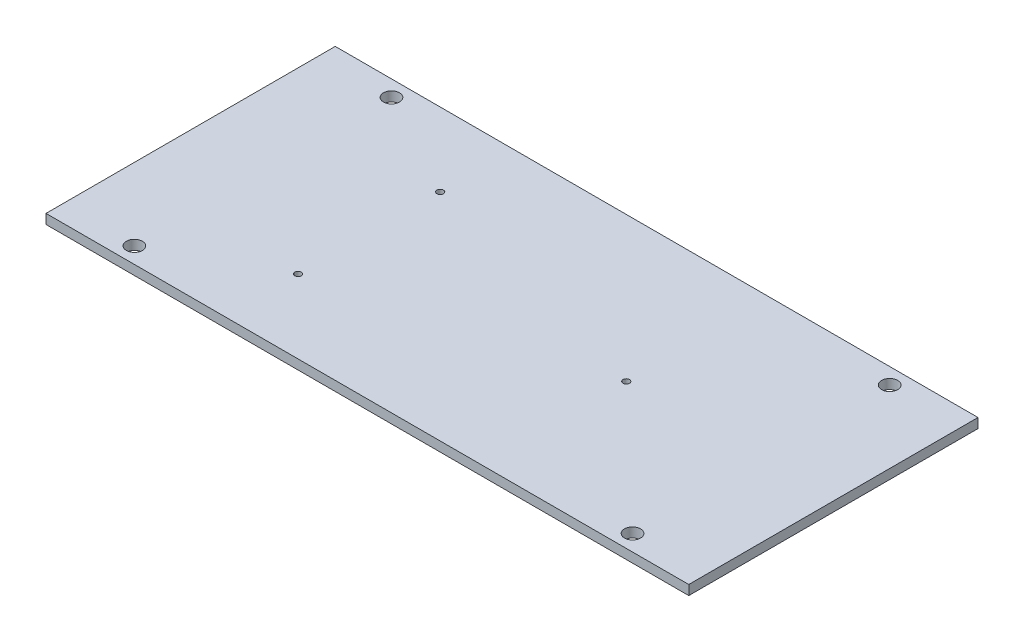
ISO-10303-21;
HEADER;
FILE_DESCRIPTION(('STEP AP214'),'2;1');
FILE_NAME('part.step','',(''),(''),'','','');
FILE_SCHEMA(('AUTOMOTIVE_DESIGN { 1 0 10303 214 1 1 1 1 }'));
ENDSEC;
DATA;
#1=APPLICATION_CONTEXT('core data for automotive mechanical design processes');
#2=APPLICATION_PROTOCOL_DEFINITION('international standard','automotive_design',2000,#1);
#3=PRODUCT_CONTEXT('',#1,'mechanical');
#4=PRODUCT('Part','Part','',(#3));
#5=PRODUCT_RELATED_PRODUCT_CATEGORY('part','',(#4));
#6=PRODUCT_DEFINITION_FORMATION('','',#4);
#7=PRODUCT_DEFINITION_CONTEXT('part definition',#1,'design');
#8=PRODUCT_DEFINITION('design','',#6,#7);
#9=PRODUCT_DEFINITION_SHAPE('','',#8);
#10=(LENGTH_UNIT() NAMED_UNIT(*) SI_UNIT(.MILLI.,.METRE.));
#11=(NAMED_UNIT(*) PLANE_ANGLE_UNIT() SI_UNIT($,.RADIAN.));
#12=(NAMED_UNIT(*) SI_UNIT($,.STERADIAN.) SOLID_ANGLE_UNIT());
#13=UNCERTAINTY_MEASURE_WITH_UNIT(LENGTH_MEASURE(1.E-05),#10,'distance_accuracy_value','');
#14=(GEOMETRIC_REPRESENTATION_CONTEXT(3) GLOBAL_UNCERTAINTY_ASSIGNED_CONTEXT((#13)) GLOBAL_UNIT_ASSIGNED_CONTEXT((#10,
#11,#12)) REPRESENTATION_CONTEXT('',''));
#15=CARTESIAN_POINT('',(0.,0.,0.));
#16=DIRECTION('',(0.,0.,1.));
#17=DIRECTION('',(1.,0.,0.));
#18=AXIS2_PLACEMENT_3D('',#15,#16,#17);
#19=CARTESIAN_POINT('',(100.,3.,45.));
#20=DIRECTION('',(-1.,0.,0.));
#21=DIRECTION('',(0.,0.,1.));
#22=AXIS2_PLACEMENT_3D('',#19,#20,#21);
#23=PLANE('',#22);
#24=DIRECTION('',(0.,0.,-1.));
#25=VECTOR('',#24,1.);
#26=CARTESIAN_POINT('',(100.,0.,45.));
#27=LINE('',#26,#25);
#28=CARTESIAN_POINT('',(100.,0.,45.));
#29=VERTEX_POINT('',#28);
#30=CARTESIAN_POINT('',(100.,0.,-45.));
#31=VERTEX_POINT('',#30);
#32=EDGE_CURVE('E100',#29,#31,#27,.T.);
#33=ORIENTED_EDGE('',*,*,#32,.T.);
#34=DIRECTION('',(0.,-1.,0.));
#35=VECTOR('',#34,1.);
#36=CARTESIAN_POINT('',(100.,3.,-45.));
#37=LINE('',#36,#35);
#38=CARTESIAN_POINT('',(100.,3.,-45.));
#39=VERTEX_POINT('',#38);
#40=EDGE_CURVE('E11',#39,#31,#37,.T.);
#41=ORIENTED_EDGE('',*,*,#40,.F.);
#42=DIRECTION('',(0.,0.,-1.));
#43=VECTOR('',#42,1.);
#44=CARTESIAN_POINT('',(100.,3.,45.));
#45=LINE('',#44,#43);
#46=CARTESIAN_POINT('',(100.,3.,45.));
#47=VERTEX_POINT('',#46);
#48=EDGE_CURVE('E88',#47,#39,#45,.T.);
#49=ORIENTED_EDGE('',*,*,#48,.F.);
#50=DIRECTION('',(0.,-1.,0.));
#51=VECTOR('',#50,1.);
#52=CARTESIAN_POINT('',(100.,3.,45.));
#53=LINE('',#52,#51);
#54=EDGE_CURVE('E96',#47,#29,#53,.T.);
#55=ORIENTED_EDGE('',*,*,#54,.T.);
#56=EDGE_LOOP('',(#33,#41,#49,#55));
#57=FACE_BOUND('',#56,.T.);
#58=ADVANCED_FACE('F37',(#57),#23,.F.);
#59=CARTESIAN_POINT('',(-100.,3.,-45.));
#60=DIRECTION('',(0.,0.,1.));
#61=DIRECTION('',(1.,0.,0.));
#62=AXIS2_PLACEMENT_3D('',#59,#60,#61);
#63=PLANE('',#62);
#64=DIRECTION('',(-1.,0.,0.));
#65=VECTOR('',#64,1.);
#66=CARTESIAN_POINT('',(-100.,0.,-45.));
#67=LINE('',#66,#65);
#68=CARTESIAN_POINT('',(-100.,0.,-45.));
#69=VERTEX_POINT('',#68);
#70=EDGE_CURVE('E92',#31,#69,#67,.T.);
#71=ORIENTED_EDGE('',*,*,#70,.T.);
#72=DIRECTION('',(0.,-1.,0.));
#73=VECTOR('',#72,1.);
#74=CARTESIAN_POINT('',(-100.,3.,-45.));
#75=LINE('',#74,#73);
#76=CARTESIAN_POINT('',(-100.,3.,-45.));
#77=VERTEX_POINT('',#76);
#78=EDGE_CURVE('E45',#77,#69,#75,.T.);
#79=ORIENTED_EDGE('',*,*,#78,.F.);
#80=DIRECTION('',(-1.,0.,0.));
#81=VECTOR('',#80,1.);
#82=CARTESIAN_POINT('',(-100.,3.,-45.));
#83=LINE('',#82,#81);
#84=EDGE_CURVE('E83',#39,#77,#83,.T.);
#85=ORIENTED_EDGE('',*,*,#84,.F.);
#86=ORIENTED_EDGE('',*,*,#40,.T.);
#87=EDGE_LOOP('',(#71,#79,#85,#86));
#88=FACE_BOUND('',#87,.T.);
#89=ADVANCED_FACE('F91',(#88),#63,.F.);
#90=CARTESIAN_POINT('',(-100.,3.,45.));
#91=DIRECTION('',(1.,0.,0.));
#92=DIRECTION('',(0.,0.,-1.));
#93=AXIS2_PLACEMENT_3D('',#90,#91,#92);
#94=PLANE('',#93);
#95=DIRECTION('',(0.,0.,1.));
#96=VECTOR('',#95,1.);
#97=CARTESIAN_POINT('',(-100.,0.,45.));
#98=LINE('',#97,#96);
#99=CARTESIAN_POINT('',(-100.,0.,45.));
#100=VERTEX_POINT('',#99);
#101=EDGE_CURVE('E70',#69,#100,#98,.T.);
#102=ORIENTED_EDGE('',*,*,#101,.T.);
#103=DIRECTION('',(0.,-1.,0.));
#104=VECTOR('',#103,1.);
#105=CARTESIAN_POINT('',(-100.,3.,45.));
#106=LINE('',#105,#104);
#107=CARTESIAN_POINT('',(-100.,3.,45.));
#108=VERTEX_POINT('',#107);
#109=EDGE_CURVE('E93',#108,#100,#106,.T.);
#110=ORIENTED_EDGE('',*,*,#109,.F.);
#111=DIRECTION('',(0.,0.,1.));
#112=VECTOR('',#111,1.);
#113=CARTESIAN_POINT('',(-100.,3.,45.));
#114=LINE('',#113,#112);
#115=EDGE_CURVE('E86',#77,#108,#114,.T.);
#116=ORIENTED_EDGE('',*,*,#115,.F.);
#117=ORIENTED_EDGE('',*,*,#78,.T.);
#118=EDGE_LOOP('',(#102,#110,#116,#117));
#119=FACE_BOUND('',#118,.T.);
#120=ADVANCED_FACE('F94',(#119),#94,.F.);
#121=CARTESIAN_POINT('',(-100.,3.,45.));
#122=DIRECTION('',(0.,0.,-1.));
#123=DIRECTION('',(-1.,0.,0.));
#124=AXIS2_PLACEMENT_3D('',#121,#122,#123);
#125=PLANE('',#124);
#126=DIRECTION('',(1.,0.,0.));
#127=VECTOR('',#126,1.);
#128=CARTESIAN_POINT('',(-100.,0.,45.));
#129=LINE('',#128,#127);
#130=EDGE_CURVE('E76',#100,#29,#129,.T.);
#131=ORIENTED_EDGE('',*,*,#130,.T.);
#132=ORIENTED_EDGE('',*,*,#54,.F.);
#133=DIRECTION('',(1.,0.,0.));
#134=VECTOR('',#133,1.);
#135=CARTESIAN_POINT('',(-100.,3.,45.));
#136=LINE('',#135,#134);
#137=EDGE_CURVE('E53',#108,#47,#136,.T.);
#138=ORIENTED_EDGE('',*,*,#137,.F.);
#139=ORIENTED_EDGE('',*,*,#109,.T.);
#140=EDGE_LOOP('',(#131,#132,#138,#139));
#141=FACE_BOUND('',#140,.T.);
#142=ADVANCED_FACE('F108',(#141),#125,.F.);
#143=CARTESIAN_POINT('',(0.,3.,0.));
#144=DIRECTION('',(0.,-1.,0.));
#145=DIRECTION('',(0.,0.,-1.));
#146=AXIS2_PLACEMENT_3D('',#143,#144,#145);
#147=PLANE('',#146);
#148=CARTESIAN_POINT('',(-44.4499999999999,3.,-22.098));
#149=DIRECTION('',(0.,1.,0.));
#150=DIRECTION('',(0.,0.,1.));
#151=AXIS2_PLACEMENT_3D('',#148,#149,#150);
#152=CIRCLE('',#151,1.0159999999979);
#153=CARTESIAN_POINT('',(-44.4499999999999,3.,-21.0820000000021));
#154=VERTEX_POINT('',#153);
#155=EDGE_CURVE('E150',#154,#154,#152,.T.);
#156=ORIENTED_EDGE('',*,*,#155,.F.);
#157=EDGE_LOOP('',(#156));
#158=FACE_BOUND('',#157,.T.);
#159=CARTESIAN_POINT('',(-44.45,3.,22.098));
#160=DIRECTION('',(0.,1.,0.));
#161=DIRECTION('',(0.,0.,1.));
#162=AXIS2_PLACEMENT_3D('',#159,#160,#161);
#163=CIRCLE('',#162,1.0159999999979);
#164=CARTESIAN_POINT('',(-44.45,3.,23.1139999999979));
#165=VERTEX_POINT('',#164);
#166=EDGE_CURVE('E144',#165,#165,#163,.T.);
#167=ORIENTED_EDGE('',*,*,#166,.F.);
#168=EDGE_LOOP('',(#167));
#169=FACE_BOUND('',#168,.T.);
#170=CARTESIAN_POINT('',(35.56,3.,0.));
#171=DIRECTION('',(0.,1.,0.));
#172=DIRECTION('',(0.,0.,1.));
#173=AXIS2_PLACEMENT_3D('',#170,#171,#172);
#174=CIRCLE('',#173,1.0159999999979);
#175=CARTESIAN_POINT('',(35.56,3.,1.01599999999789));
#176=VERTEX_POINT('',#175);
#177=EDGE_CURVE('E138',#176,#176,#174,.T.);
#178=ORIENTED_EDGE('',*,*,#177,.F.);
#179=EDGE_LOOP('',(#178));
#180=FACE_BOUND('',#179,.T.);
#181=CARTESIAN_POINT('',(-77.5,3.,40.));
#182=DIRECTION('',(0.,1.,0.));
#183=DIRECTION('',(0.,0.,1.));
#184=AXIS2_PLACEMENT_3D('',#181,#182,#183);
#185=CIRCLE('',#184,2.50000000000001);
#186=CARTESIAN_POINT('',(-77.5,3.,42.5));
#187=VERTEX_POINT('',#186);
#188=EDGE_CURVE('E120',#187,#187,#185,.T.);
#189=ORIENTED_EDGE('',*,*,#188,.F.);
#190=EDGE_LOOP('',(#189));
#191=FACE_BOUND('',#190,.T.);
#192=CARTESIAN_POINT('',(77.5,3.,40.));
#193=DIRECTION('',(0.,1.,0.));
#194=DIRECTION('',(0.,0.,1.));
#195=AXIS2_PLACEMENT_3D('',#192,#193,#194);
#196=CIRCLE('',#195,2.50000000000001);
#197=CARTESIAN_POINT('',(77.5,3.,42.5));
#198=VERTEX_POINT('',#197);
#199=EDGE_CURVE('E127',#198,#198,#196,.T.);
#200=ORIENTED_EDGE('',*,*,#199,.F.);
#201=EDGE_LOOP('',(#200));
#202=FACE_BOUND('',#201,.T.);
#203=CARTESIAN_POINT('',(77.5,3.,-40.));
#204=DIRECTION('',(0.,1.,0.));
#205=DIRECTION('',(0.,0.,1.));
#206=AXIS2_PLACEMENT_3D('',#203,#204,#205);
#207=CIRCLE('',#206,2.50000000000001);
#208=CARTESIAN_POINT('',(77.5,3.,-37.5));
#209=VERTEX_POINT('',#208);
#210=EDGE_CURVE('E133',#209,#209,#207,.T.);
#211=ORIENTED_EDGE('',*,*,#210,.F.);
#212=EDGE_LOOP('',(#211));
#213=FACE_BOUND('',#212,.T.);
#214=CARTESIAN_POINT('',(-77.5,3.,-40.));
#215=DIRECTION('',(0.,1.,0.));
#216=DIRECTION('',(0.,0.,1.));
#217=AXIS2_PLACEMENT_3D('',#214,#215,#216);
#218=CIRCLE('',#217,2.50000000000002);
#219=CARTESIAN_POINT('',(-77.5,3.,-37.5));
#220=VERTEX_POINT('',#219);
#221=EDGE_CURVE('E114',#220,#220,#218,.T.);
#222=ORIENTED_EDGE('',*,*,#221,.F.);
#223=EDGE_LOOP('',(#222));
#224=FACE_BOUND('',#223,.T.);
#225=ORIENTED_EDGE('',*,*,#48,.T.);
#226=ORIENTED_EDGE('',*,*,#84,.T.);
#227=ORIENTED_EDGE('',*,*,#115,.T.);
#228=ORIENTED_EDGE('',*,*,#137,.T.);
#229=EDGE_LOOP('',(#225,#226,#227,#228));
#230=FACE_BOUND('',#229,.T.);
#231=ADVANCED_FACE('F84',(#158,#169,#180,#191,#202,#213,#224,#230),#147,.F.);
#232=CARTESIAN_POINT('',(0.,0.,0.));
#233=DIRECTION('',(0.,-1.,0.));
#234=DIRECTION('',(0.,0.,-1.));
#235=AXIS2_PLACEMENT_3D('',#232,#233,#234);
#236=PLANE('',#235);
#237=CARTESIAN_POINT('',(-44.4499999999999,0.,-22.098));
#238=DIRECTION('',(0.,1.,0.));
#239=DIRECTION('',(0.,0.,1.));
#240=AXIS2_PLACEMENT_3D('',#237,#238,#239);
#241=CIRCLE('',#240,1.0159999999979);
#242=CARTESIAN_POINT('',(-44.4499999999999,0.,-21.0820000000021));
#243=VERTEX_POINT('',#242);
#244=EDGE_CURVE('E124',#243,#243,#241,.T.);
#245=ORIENTED_EDGE('',*,*,#244,.T.);
#246=EDGE_LOOP('',(#245));
#247=FACE_BOUND('',#246,.T.);
#248=CARTESIAN_POINT('',(-44.45,0.,22.098));
#249=DIRECTION('',(0.,1.,0.));
#250=DIRECTION('',(0.,0.,1.));
#251=AXIS2_PLACEMENT_3D('',#248,#249,#250);
#252=CIRCLE('',#251,1.0159999999979);
#253=CARTESIAN_POINT('',(-44.45,0.,23.1139999999979));
#254=VERTEX_POINT('',#253);
#255=EDGE_CURVE('E147',#254,#254,#252,.T.);
#256=ORIENTED_EDGE('',*,*,#255,.T.);
#257=EDGE_LOOP('',(#256));
#258=FACE_BOUND('',#257,.T.);
#259=CARTESIAN_POINT('',(35.56,0.,0.));
#260=DIRECTION('',(0.,1.,0.));
#261=DIRECTION('',(0.,0.,1.));
#262=AXIS2_PLACEMENT_3D('',#259,#260,#261);
#263=CIRCLE('',#262,1.0159999999979);
#264=CARTESIAN_POINT('',(35.56,0.,1.01599999999789));
#265=VERTEX_POINT('',#264);
#266=EDGE_CURVE('E141',#265,#265,#263,.T.);
#267=ORIENTED_EDGE('',*,*,#266,.T.);
#268=EDGE_LOOP('',(#267));
#269=FACE_BOUND('',#268,.T.);
#270=CARTESIAN_POINT('',(-77.5,0.,40.));
#271=DIRECTION('',(0.,1.,0.));
#272=DIRECTION('',(0.,0.,1.));
#273=AXIS2_PLACEMENT_3D('',#270,#271,#272);
#274=CIRCLE('',#273,2.50000000000001);
#275=CARTESIAN_POINT('',(-77.5,0.,42.5));
#276=VERTEX_POINT('',#275);
#277=EDGE_CURVE('E123',#276,#276,#274,.T.);
#278=ORIENTED_EDGE('',*,*,#277,.T.);
#279=EDGE_LOOP('',(#278));
#280=FACE_BOUND('',#279,.T.);
#281=CARTESIAN_POINT('',(77.5,0.,40.));
#282=DIRECTION('',(0.,1.,0.));
#283=DIRECTION('',(0.,0.,1.));
#284=AXIS2_PLACEMENT_3D('',#281,#282,#283);
#285=CIRCLE('',#284,2.50000000000001);
#286=CARTESIAN_POINT('',(77.5,0.,42.5));
#287=VERTEX_POINT('',#286);
#288=EDGE_CURVE('E130',#287,#287,#285,.T.);
#289=ORIENTED_EDGE('',*,*,#288,.T.);
#290=EDGE_LOOP('',(#289));
#291=FACE_BOUND('',#290,.T.);
#292=CARTESIAN_POINT('',(77.5,0.,-40.));
#293=DIRECTION('',(0.,1.,0.));
#294=DIRECTION('',(0.,0.,1.));
#295=AXIS2_PLACEMENT_3D('',#292,#293,#294);
#296=CIRCLE('',#295,2.50000000000001);
#297=CARTESIAN_POINT('',(77.5,0.,-37.5));
#298=VERTEX_POINT('',#297);
#299=EDGE_CURVE('E117',#298,#298,#296,.T.);
#300=ORIENTED_EDGE('',*,*,#299,.T.);
#301=EDGE_LOOP('',(#300));
#302=FACE_BOUND('',#301,.T.);
#303=CARTESIAN_POINT('',(-77.5,0.,-40.));
#304=DIRECTION('',(0.,1.,0.));
#305=DIRECTION('',(0.,0.,1.));
#306=AXIS2_PLACEMENT_3D('',#303,#304,#305);
#307=CIRCLE('',#306,2.50000000000002);
#308=CARTESIAN_POINT('',(-77.5,0.,-37.5));
#309=VERTEX_POINT('',#308);
#310=EDGE_CURVE('E103',#309,#309,#307,.T.);
#311=ORIENTED_EDGE('',*,*,#310,.T.);
#312=EDGE_LOOP('',(#311));
#313=FACE_BOUND('',#312,.T.);
#314=ORIENTED_EDGE('',*,*,#32,.F.);
#315=ORIENTED_EDGE('',*,*,#130,.F.);
#316=ORIENTED_EDGE('',*,*,#101,.F.);
#317=ORIENTED_EDGE('',*,*,#70,.F.);
#318=EDGE_LOOP('',(#314,#315,#316,#317));
#319=FACE_BOUND('',#318,.T.);
#320=ADVANCED_FACE('F111',(#247,#258,#269,#280,#291,#302,#313,#319),#236,.T.);
#321=CARTESIAN_POINT('',(-77.5,0.,-40.));
#322=DIRECTION('',(0.,1.,0.));
#323=DIRECTION('',(0.,0.,1.));
#324=AXIS2_PLACEMENT_3D('',#321,#322,#323);
#325=CYLINDRICAL_SURFACE('',#324,2.50000000000002);
#326=ORIENTED_EDGE('',*,*,#310,.F.);
#327=EDGE_LOOP('',(#326));
#328=FACE_BOUND('',#327,.T.);
#329=ORIENTED_EDGE('',*,*,#221,.T.);
#330=EDGE_LOOP('',(#329));
#331=FACE_BOUND('',#330,.T.);
#332=ADVANCED_FACE('F180',(#328,#331),#325,.F.);
#333=CARTESIAN_POINT('',(77.5,0.,-40.));
#334=DIRECTION('',(0.,1.,0.));
#335=DIRECTION('',(0.,0.,1.));
#336=AXIS2_PLACEMENT_3D('',#333,#334,#335);
#337=CYLINDRICAL_SURFACE('',#336,2.50000000000001);
#338=ORIENTED_EDGE('',*,*,#299,.F.);
#339=EDGE_LOOP('',(#338));
#340=FACE_BOUND('',#339,.T.);
#341=ORIENTED_EDGE('',*,*,#210,.T.);
#342=EDGE_LOOP('',(#341));
#343=FACE_BOUND('',#342,.T.);
#344=ADVANCED_FACE('F182',(#340,#343),#337,.F.);
#345=CARTESIAN_POINT('',(77.5,0.,40.));
#346=DIRECTION('',(0.,1.,0.));
#347=DIRECTION('',(0.,0.,1.));
#348=AXIS2_PLACEMENT_3D('',#345,#346,#347);
#349=CYLINDRICAL_SURFACE('',#348,2.50000000000001);
#350=ORIENTED_EDGE('',*,*,#288,.F.);
#351=EDGE_LOOP('',(#350));
#352=FACE_BOUND('',#351,.T.);
#353=ORIENTED_EDGE('',*,*,#199,.T.);
#354=EDGE_LOOP('',(#353));
#355=FACE_BOUND('',#354,.T.);
#356=ADVANCED_FACE('F189',(#352,#355),#349,.F.);
#357=CARTESIAN_POINT('',(-77.5,0.,40.));
#358=DIRECTION('',(0.,1.,0.));
#359=DIRECTION('',(0.,0.,1.));
#360=AXIS2_PLACEMENT_3D('',#357,#358,#359);
#361=CYLINDRICAL_SURFACE('',#360,2.50000000000001);
#362=ORIENTED_EDGE('',*,*,#277,.F.);
#363=EDGE_LOOP('',(#362));
#364=FACE_BOUND('',#363,.T.);
#365=ORIENTED_EDGE('',*,*,#188,.T.);
#366=EDGE_LOOP('',(#365));
#367=FACE_BOUND('',#366,.T.);
#368=ADVANCED_FACE('F234',(#364,#367),#361,.F.);
#369=CARTESIAN_POINT('',(35.56,0.,0.));
#370=DIRECTION('',(0.,1.,0.));
#371=DIRECTION('',(0.,0.,1.));
#372=AXIS2_PLACEMENT_3D('',#369,#370,#371);
#373=CYLINDRICAL_SURFACE('',#372,1.0159999999979);
#374=ORIENTED_EDGE('',*,*,#266,.F.);
#375=EDGE_LOOP('',(#374));
#376=FACE_BOUND('',#375,.T.);
#377=ORIENTED_EDGE('',*,*,#177,.T.);
#378=EDGE_LOOP('',(#377));
#379=FACE_BOUND('',#378,.T.);
#380=ADVANCED_FACE('F229',(#376,#379),#373,.F.);
#381=CARTESIAN_POINT('',(-44.45,0.,22.098));
#382=DIRECTION('',(0.,1.,0.));
#383=DIRECTION('',(0.,0.,1.));
#384=AXIS2_PLACEMENT_3D('',#381,#382,#383);
#385=CYLINDRICAL_SURFACE('',#384,1.0159999999979);
#386=ORIENTED_EDGE('',*,*,#255,.F.);
#387=EDGE_LOOP('',(#386));
#388=FACE_BOUND('',#387,.T.);
#389=ORIENTED_EDGE('',*,*,#166,.T.);
#390=EDGE_LOOP('',(#389));
#391=FACE_BOUND('',#390,.T.);
#392=ADVANCED_FACE('F161',(#388,#391),#385,.F.);
#393=CARTESIAN_POINT('',(-44.4499999999999,0.,-22.098));
#394=DIRECTION('',(0.,1.,0.));
#395=DIRECTION('',(0.,0.,1.));
#396=AXIS2_PLACEMENT_3D('',#393,#394,#395);
#397=CYLINDRICAL_SURFACE('',#396,1.0159999999979);
#398=ORIENTED_EDGE('',*,*,#244,.F.);
#399=EDGE_LOOP('',(#398));
#400=FACE_BOUND('',#399,.T.);
#401=ORIENTED_EDGE('',*,*,#155,.T.);
#402=EDGE_LOOP('',(#401));
#403=FACE_BOUND('',#402,.T.);
#404=ADVANCED_FACE('F158',(#400,#403),#397,.F.);
#405=CLOSED_SHELL('',(#58,#89,#120,#142,#231,#320,#332,#344,#356,#368,#380,#392,#404));
#406=MANIFOLD_SOLID_BREP('B2',#405);
#407=ADVANCED_BREP_SHAPE_REPRESENTATION('',(#18,#406),#14);
#408=SHAPE_DEFINITION_REPRESENTATION(#9,#407);
ENDSEC;
END-ISO-10303-21;
